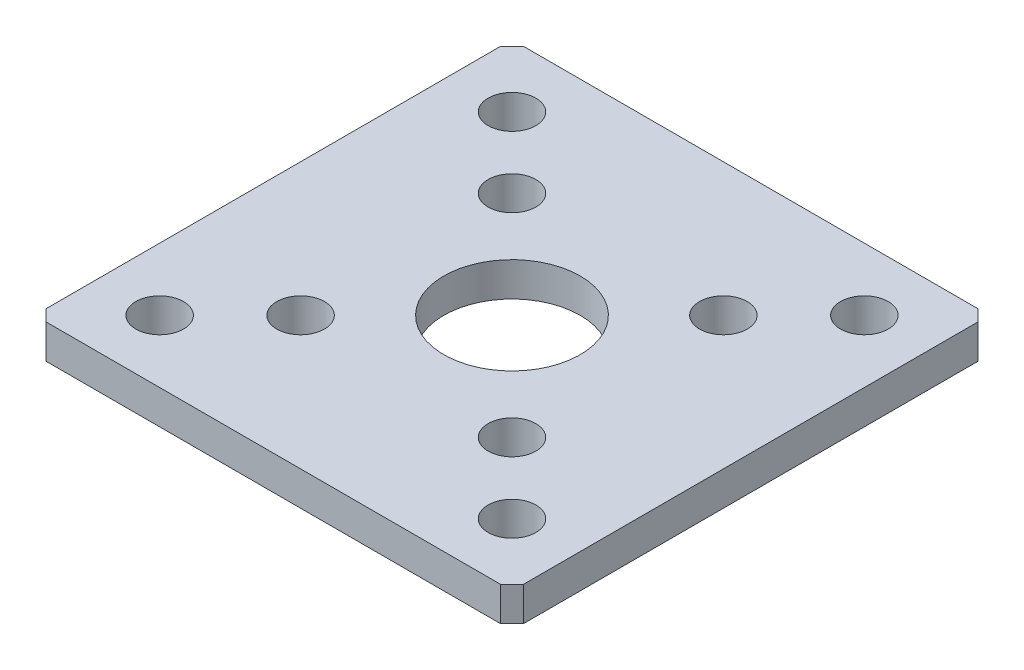
ISO-10303-21;
HEADER;
FILE_DESCRIPTION(('STEP AP214'),'2;1');
FILE_NAME('part.step','',(''),(''),'','','');
FILE_SCHEMA(('AUTOMOTIVE_DESIGN { 1 0 10303 214 1 1 1 1 }'));
ENDSEC;
DATA;
#1=APPLICATION_CONTEXT('core data for automotive mechanical design processes');
#2=APPLICATION_PROTOCOL_DEFINITION('international standard','automotive_design',2000,#1);
#3=PRODUCT_CONTEXT('',#1,'mechanical');
#4=PRODUCT('Part','Part','',(#3));
#5=PRODUCT_RELATED_PRODUCT_CATEGORY('part','',(#4));
#6=PRODUCT_DEFINITION_FORMATION('','',#4);
#7=PRODUCT_DEFINITION_CONTEXT('part definition',#1,'design');
#8=PRODUCT_DEFINITION('design','',#6,#7);
#9=PRODUCT_DEFINITION_SHAPE('','',#8);
#10=(LENGTH_UNIT() NAMED_UNIT(*) SI_UNIT(.MILLI.,.METRE.));
#11=(NAMED_UNIT(*) PLANE_ANGLE_UNIT() SI_UNIT($,.RADIAN.));
#12=(NAMED_UNIT(*) SI_UNIT($,.STERADIAN.) SOLID_ANGLE_UNIT());
#13=UNCERTAINTY_MEASURE_WITH_UNIT(LENGTH_MEASURE(1.E-05),#10,'distance_accuracy_value','');
#14=(GEOMETRIC_REPRESENTATION_CONTEXT(3) GLOBAL_UNCERTAINTY_ASSIGNED_CONTEXT((#13)) GLOBAL_UNIT_ASSIGNED_CONTEXT((#10,
#11,#12)) REPRESENTATION_CONTEXT('',''));
#15=CARTESIAN_POINT('',(0.,0.,0.));
#16=DIRECTION('',(0.,0.,1.));
#17=DIRECTION('',(1.,0.,0.));
#18=AXIS2_PLACEMENT_3D('',#15,#16,#17);
#19=CARTESIAN_POINT('',(21.,3.,21.));
#20=DIRECTION('',(-1.,0.,0.));
#21=DIRECTION('',(0.,0.,1.));
#22=AXIS2_PLACEMENT_3D('',#19,#20,#21);
#23=PLANE('',#22);
#24=DIRECTION('',(0.,0.,-1.));
#25=VECTOR('',#24,1.);
#26=CARTESIAN_POINT('',(21.,0.,21.));
#27=LINE('',#26,#25);
#28=CARTESIAN_POINT('',(21.,0.,20.));
#29=VERTEX_POINT('',#28);
#30=CARTESIAN_POINT('',(21.,0.,-20.));
#31=VERTEX_POINT('',#30);
#32=EDGE_CURVE('E128',#29,#31,#27,.T.);
#33=ORIENTED_EDGE('',*,*,#32,.T.);
#34=DIRECTION('',(0.,1.,0.));
#35=VECTOR('',#34,1.);
#36=CARTESIAN_POINT('',(21.,3.,-20.));
#37=LINE('',#36,#35);
#38=CARTESIAN_POINT('',(21.,3.,-20.));
#39=VERTEX_POINT('',#38);
#40=EDGE_CURVE('E106',#31,#39,#37,.T.);
#41=ORIENTED_EDGE('',*,*,#40,.T.);
#42=DIRECTION('',(0.,0.,-1.));
#43=VECTOR('',#42,1.);
#44=CARTESIAN_POINT('',(21.,3.,21.));
#45=LINE('',#44,#43);
#46=CARTESIAN_POINT('',(21.,3.,20.));
#47=VERTEX_POINT('',#46);
#48=EDGE_CURVE('E138',#47,#39,#45,.T.);
#49=ORIENTED_EDGE('',*,*,#48,.F.);
#50=DIRECTION('',(0.,-1.,0.));
#51=VECTOR('',#50,1.);
#52=CARTESIAN_POINT('',(21.,3.,20.));
#53=LINE('',#52,#51);
#54=EDGE_CURVE('E111',#47,#29,#53,.T.);
#55=ORIENTED_EDGE('',*,*,#54,.T.);
#56=EDGE_LOOP('',(#33,#41,#49,#55));
#57=FACE_BOUND('',#56,.T.);
#58=ADVANCED_FACE('F35',(#57),#23,.F.);
#59=CARTESIAN_POINT('',(-21.,3.,-21.));
#60=DIRECTION('',(0.,0.,1.));
#61=DIRECTION('',(1.,0.,0.));
#62=AXIS2_PLACEMENT_3D('',#59,#60,#61);
#63=PLANE('',#62);
#64=DIRECTION('',(-1.,0.,0.));
#65=VECTOR('',#64,1.);
#66=CARTESIAN_POINT('',(-21.,3.,-21.));
#67=LINE('',#66,#65);
#68=CARTESIAN_POINT('',(20.,3.,-21.));
#69=VERTEX_POINT('',#68);
#70=CARTESIAN_POINT('',(-20.,3.,-21.));
#71=VERTEX_POINT('',#70);
#72=EDGE_CURVE('E121',#69,#71,#67,.T.);
#73=ORIENTED_EDGE('',*,*,#72,.F.);
#74=DIRECTION('',(0.,-1.,0.));
#75=VECTOR('',#74,1.);
#76=CARTESIAN_POINT('',(20.,3.,-21.));
#77=LINE('',#76,#75);
#78=CARTESIAN_POINT('',(20.,0.,-21.));
#79=VERTEX_POINT('',#78);
#80=EDGE_CURVE('E105',#69,#79,#77,.T.);
#81=ORIENTED_EDGE('',*,*,#80,.T.);
#82=DIRECTION('',(-1.,0.,0.));
#83=VECTOR('',#82,1.);
#84=CARTESIAN_POINT('',(-21.,0.,-21.));
#85=LINE('',#84,#83);
#86=CARTESIAN_POINT('',(-20.,0.,-21.));
#87=VERTEX_POINT('',#86);
#88=EDGE_CURVE('E118',#79,#87,#85,.T.);
#89=ORIENTED_EDGE('',*,*,#88,.T.);
#90=DIRECTION('',(0.,1.,0.));
#91=VECTOR('',#90,1.);
#92=CARTESIAN_POINT('',(-20.,3.,-21.));
#93=LINE('',#92,#91);
#94=EDGE_CURVE('E123',#87,#71,#93,.T.);
#95=ORIENTED_EDGE('',*,*,#94,.T.);
#96=EDGE_LOOP('',(#73,#81,#89,#95));
#97=FACE_BOUND('',#96,.T.);
#98=ADVANCED_FACE('F117',(#97),#63,.F.);
#99=CARTESIAN_POINT('',(-21.,3.,21.));
#100=DIRECTION('',(1.,0.,0.));
#101=DIRECTION('',(0.,0.,-1.));
#102=AXIS2_PLACEMENT_3D('',#99,#100,#101);
#103=PLANE('',#102);
#104=DIRECTION('',(0.,0.,1.));
#105=VECTOR('',#104,1.);
#106=CARTESIAN_POINT('',(-21.,0.,21.));
#107=LINE('',#106,#105);
#108=CARTESIAN_POINT('',(-21.,0.,-20.));
#109=VERTEX_POINT('',#108);
#110=CARTESIAN_POINT('',(-21.,0.,20.));
#111=VERTEX_POINT('',#110);
#112=EDGE_CURVE('E127',#109,#111,#107,.T.);
#113=ORIENTED_EDGE('',*,*,#112,.T.);
#114=DIRECTION('',(0.,1.,0.));
#115=VECTOR('',#114,1.);
#116=CARTESIAN_POINT('',(-21.,3.,20.));
#117=LINE('',#116,#115);
#118=CARTESIAN_POINT('',(-21.,3.,20.));
#119=VERTEX_POINT('',#118);
#120=EDGE_CURVE('E11',#111,#119,#117,.T.);
#121=ORIENTED_EDGE('',*,*,#120,.T.);
#122=DIRECTION('',(0.,0.,1.));
#123=VECTOR('',#122,1.);
#124=CARTESIAN_POINT('',(-21.,3.,21.));
#125=LINE('',#124,#123);
#126=CARTESIAN_POINT('',(-21.,3.,-20.));
#127=VERTEX_POINT('',#126);
#128=EDGE_CURVE('E164',#127,#119,#125,.T.);
#129=ORIENTED_EDGE('',*,*,#128,.F.);
#130=DIRECTION('',(0.,-1.,0.));
#131=VECTOR('',#130,1.);
#132=CARTESIAN_POINT('',(-21.,3.,-20.));
#133=LINE('',#132,#131);
#134=EDGE_CURVE('E43',#127,#109,#133,.T.);
#135=ORIENTED_EDGE('',*,*,#134,.T.);
#136=EDGE_LOOP('',(#113,#121,#129,#135));
#137=FACE_BOUND('',#136,.T.);
#138=ADVANCED_FACE('F162',(#137),#103,.F.);
#139=CARTESIAN_POINT('',(-21.,3.,21.));
#140=DIRECTION('',(0.,0.,-1.));
#141=DIRECTION('',(-1.,0.,0.));
#142=AXIS2_PLACEMENT_3D('',#139,#140,#141);
#143=PLANE('',#142);
#144=DIRECTION('',(1.,0.,0.));
#145=VECTOR('',#144,1.);
#146=CARTESIAN_POINT('',(-21.,0.,21.));
#147=LINE('',#146,#145);
#148=CARTESIAN_POINT('',(-20.,0.,21.));
#149=VERTEX_POINT('',#148);
#150=CARTESIAN_POINT('',(20.,0.,21.));
#151=VERTEX_POINT('',#150);
#152=EDGE_CURVE('E131',#149,#151,#147,.T.);
#153=ORIENTED_EDGE('',*,*,#152,.T.);
#154=DIRECTION('',(0.,1.,0.));
#155=VECTOR('',#154,1.);
#156=CARTESIAN_POINT('',(20.,3.,21.));
#157=LINE('',#156,#155);
#158=CARTESIAN_POINT('',(20.,3.,21.));
#159=VERTEX_POINT('',#158);
#160=EDGE_CURVE('E50',#151,#159,#157,.T.);
#161=ORIENTED_EDGE('',*,*,#160,.T.);
#162=DIRECTION('',(1.,0.,0.));
#163=VECTOR('',#162,1.);
#164=CARTESIAN_POINT('',(-21.,3.,21.));
#165=LINE('',#164,#163);
#166=CARTESIAN_POINT('',(-20.,3.,21.));
#167=VERTEX_POINT('',#166);
#168=EDGE_CURVE('E139',#167,#159,#165,.T.);
#169=ORIENTED_EDGE('',*,*,#168,.F.);
#170=DIRECTION('',(0.,-1.,0.));
#171=VECTOR('',#170,1.);
#172=CARTESIAN_POINT('',(-20.,3.,21.));
#173=LINE('',#172,#171);
#174=EDGE_CURVE('E155',#167,#149,#173,.T.);
#175=ORIENTED_EDGE('',*,*,#174,.T.);
#176=EDGE_LOOP('',(#153,#161,#169,#175));
#177=FACE_BOUND('',#176,.T.);
#178=ADVANCED_FACE('F171',(#177),#143,.F.);
#179=CARTESIAN_POINT('',(0.,3.,0.));
#180=DIRECTION('',(0.,-1.,0.));
#181=DIRECTION('',(0.,0.,-1.));
#182=AXIS2_PLACEMENT_3D('',#179,#180,#181);
#183=PLANE('',#182);
#184=CARTESIAN_POINT('',(-15.4999999999999,3.,15.5000000000001));
#185=DIRECTION('',(0.,1.,0.));
#186=DIRECTION('',(1.,0.,0.));
#187=AXIS2_PLACEMENT_3D('',#184,#185,#186);
#188=CIRCLE('',#187,2.1);
#189=CARTESIAN_POINT('',(-13.3999999999999,3.,15.5));
#190=VERTEX_POINT('',#189);
#191=EDGE_CURVE('E226',#190,#190,#188,.T.);
#192=ORIENTED_EDGE('',*,*,#191,.F.);
#193=EDGE_LOOP('',(#192));
#194=FACE_BOUND('',#193,.T.);
#195=CARTESIAN_POINT('',(15.5,3.,15.5));
#196=DIRECTION('',(0.,1.,0.));
#197=DIRECTION('',(0.,0.,-1.));
#198=AXIS2_PLACEMENT_3D('',#195,#196,#197);
#199=CIRCLE('',#198,2.1);
#200=CARTESIAN_POINT('',(15.5,3.,13.4));
#201=VERTEX_POINT('',#200);
#202=EDGE_CURVE('E220',#201,#201,#199,.T.);
#203=ORIENTED_EDGE('',*,*,#202,.F.);
#204=EDGE_LOOP('',(#203));
#205=FACE_BOUND('',#204,.T.);
#206=CARTESIAN_POINT('',(15.4999999999998,3.,-15.5000000000002));
#207=DIRECTION('',(0.,1.,0.));
#208=DIRECTION('',(-1.,0.,0.));
#209=AXIS2_PLACEMENT_3D('',#206,#207,#208);
#210=CIRCLE('',#209,2.1);
#211=CARTESIAN_POINT('',(13.3999999999998,3.,-15.5000000000001));
#212=VERTEX_POINT('',#211);
#213=EDGE_CURVE('E214',#212,#212,#210,.T.);
#214=ORIENTED_EDGE('',*,*,#213,.F.);
#215=EDGE_LOOP('',(#214));
#216=FACE_BOUND('',#215,.T.);
#217=CARTESIAN_POINT('',(-9.29999999999997,3.,9.30000000000003));
#218=DIRECTION('',(0.,1.,0.));
#219=DIRECTION('',(1.,0.,0.));
#220=AXIS2_PLACEMENT_3D('',#217,#218,#219);
#221=CIRCLE('',#220,2.1);
#222=CARTESIAN_POINT('',(-7.19999999999997,3.,9.30000000000003));
#223=VERTEX_POINT('',#222);
#224=EDGE_CURVE('E209',#223,#223,#221,.T.);
#225=ORIENTED_EDGE('',*,*,#224,.F.);
#226=EDGE_LOOP('',(#225));
#227=FACE_BOUND('',#226,.T.);
#228=CARTESIAN_POINT('',(9.3,3.,9.3));
#229=DIRECTION('',(0.,1.,0.));
#230=DIRECTION('',(0.,0.,-1.));
#231=AXIS2_PLACEMENT_3D('',#228,#229,#230);
#232=CIRCLE('',#231,2.1);
#233=CARTESIAN_POINT('',(9.3,3.,7.2));
#234=VERTEX_POINT('',#233);
#235=EDGE_CURVE('E203',#234,#234,#232,.T.);
#236=ORIENTED_EDGE('',*,*,#235,.F.);
#237=EDGE_LOOP('',(#236));
#238=FACE_BOUND('',#237,.T.);
#239=CARTESIAN_POINT('',(9.2999999999999,3.,-9.3000000000001));
#240=DIRECTION('',(0.,1.,0.));
#241=DIRECTION('',(-1.,0.,0.));
#242=AXIS2_PLACEMENT_3D('',#239,#240,#241);
#243=CIRCLE('',#242,2.1);
#244=CARTESIAN_POINT('',(7.1999999999999,3.,-9.30000000000008));
#245=VERTEX_POINT('',#244);
#246=EDGE_CURVE('E196',#245,#245,#243,.T.);
#247=ORIENTED_EDGE('',*,*,#246,.F.);
#248=EDGE_LOOP('',(#247));
#249=FACE_BOUND('',#248,.T.);
#250=CARTESIAN_POINT('',(-15.5,3.,-15.5));
#251=DIRECTION('',(0.,1.,0.));
#252=DIRECTION('',(0.,0.,1.));
#253=AXIS2_PLACEMENT_3D('',#250,#251,#252);
#254=CIRCLE('',#253,2.1);
#255=CARTESIAN_POINT('',(-15.5,3.,-13.4));
#256=VERTEX_POINT('',#255);
#257=EDGE_CURVE('E190',#256,#256,#254,.T.);
#258=ORIENTED_EDGE('',*,*,#257,.F.);
#259=EDGE_LOOP('',(#258));
#260=FACE_BOUND('',#259,.T.);
#261=CARTESIAN_POINT('',(-9.3,3.,-9.3));
#262=DIRECTION('',(0.,1.,0.));
#263=DIRECTION('',(0.,0.,1.));
#264=AXIS2_PLACEMENT_3D('',#261,#262,#263);
#265=CIRCLE('',#264,2.1);
#266=CARTESIAN_POINT('',(-9.3,3.,-7.2));
#267=VERTEX_POINT('',#266);
#268=EDGE_CURVE('E184',#267,#267,#265,.T.);
#269=ORIENTED_EDGE('',*,*,#268,.F.);
#270=EDGE_LOOP('',(#269));
#271=FACE_BOUND('',#270,.T.);
#272=CARTESIAN_POINT('',(0.,3.,0.));
#273=DIRECTION('',(0.,-1.,0.));
#274=DIRECTION('',(0.,0.,-1.));
#275=AXIS2_PLACEMENT_3D('',#272,#273,#274);
#276=CIRCLE('',#275,6.);
#277=CARTESIAN_POINT('',(0.,3.,-6.));
#278=VERTEX_POINT('',#277);
#279=EDGE_CURVE('E133',#278,#278,#276,.T.);
#280=ORIENTED_EDGE('',*,*,#279,.T.);
#281=EDGE_LOOP('',(#280));
#282=FACE_BOUND('',#281,.T.);
#283=ORIENTED_EDGE('',*,*,#48,.T.);
#284=DIRECTION('',(0.707106781186548,0.,0.707106781186548));
#285=VECTOR('',#284,1.);
#286=CARTESIAN_POINT('',(20.,3.,-21.));
#287=LINE('',#286,#285);
#288=EDGE_CURVE('E153',#39,#69,#287,.F.);
#289=ORIENTED_EDGE('',*,*,#288,.T.);
#290=ORIENTED_EDGE('',*,*,#72,.T.);
#291=DIRECTION('',(0.707106781186548,0.,-0.707106781186548));
#292=VECTOR('',#291,1.);
#293=CARTESIAN_POINT('',(-21.,3.,-20.));
#294=LINE('',#293,#292);
#295=EDGE_CURVE('E148',#71,#127,#294,.F.);
#296=ORIENTED_EDGE('',*,*,#295,.T.);
#297=ORIENTED_EDGE('',*,*,#128,.T.);
#298=DIRECTION('',(-0.707106781186548,0.,-0.707106781186548));
#299=VECTOR('',#298,1.);
#300=CARTESIAN_POINT('',(-20.,3.,21.));
#301=LINE('',#300,#299);
#302=EDGE_CURVE('E57',#119,#167,#301,.F.);
#303=ORIENTED_EDGE('',*,*,#302,.T.);
#304=ORIENTED_EDGE('',*,*,#168,.T.);
#305=DIRECTION('',(-0.707106781186548,0.,0.707106781186548));
#306=VECTOR('',#305,1.);
#307=CARTESIAN_POINT('',(21.,3.,20.));
#308=LINE('',#307,#306);
#309=EDGE_CURVE('E151',#159,#47,#308,.F.);
#310=ORIENTED_EDGE('',*,*,#309,.T.);
#311=EDGE_LOOP('',(#283,#289,#290,#296,#297,#303,#304,#310));
#312=FACE_BOUND('',#311,.T.);
#313=ADVANCED_FACE('F241',(#194,#205,#216,#227,#238,#249,#260,#271,#282,#312),#183,.F.);
#314=CARTESIAN_POINT('',(0.,0.,0.));
#315=DIRECTION('',(0.,-1.,0.));
#316=DIRECTION('',(0.,0.,-1.));
#317=AXIS2_PLACEMENT_3D('',#314,#315,#316);
#318=PLANE('',#317);
#319=CARTESIAN_POINT('',(-15.4999999999999,0.,15.5000000000001));
#320=DIRECTION('',(0.,1.,0.));
#321=DIRECTION('',(1.,0.,0.));
#322=AXIS2_PLACEMENT_3D('',#319,#320,#321);
#323=CIRCLE('',#322,2.1);
#324=CARTESIAN_POINT('',(-13.3999999999999,0.,15.5));
#325=VERTEX_POINT('',#324);
#326=EDGE_CURVE('E200',#325,#325,#323,.T.);
#327=ORIENTED_EDGE('',*,*,#326,.T.);
#328=EDGE_LOOP('',(#327));
#329=FACE_BOUND('',#328,.T.);
#330=CARTESIAN_POINT('',(15.5,0.,15.5));
#331=DIRECTION('',(0.,1.,0.));
#332=DIRECTION('',(0.,0.,-1.));
#333=AXIS2_PLACEMENT_3D('',#330,#331,#332);
#334=CIRCLE('',#333,2.1);
#335=CARTESIAN_POINT('',(15.5,0.,13.4));
#336=VERTEX_POINT('',#335);
#337=EDGE_CURVE('E223',#336,#336,#334,.T.);
#338=ORIENTED_EDGE('',*,*,#337,.T.);
#339=EDGE_LOOP('',(#338));
#340=FACE_BOUND('',#339,.T.);
#341=CARTESIAN_POINT('',(15.4999999999998,0.,-15.5000000000002));
#342=DIRECTION('',(0.,1.,0.));
#343=DIRECTION('',(-1.,0.,0.));
#344=AXIS2_PLACEMENT_3D('',#341,#342,#343);
#345=CIRCLE('',#344,2.1);
#346=CARTESIAN_POINT('',(13.3999999999998,0.,-15.5000000000001));
#347=VERTEX_POINT('',#346);
#348=EDGE_CURVE('E217',#347,#347,#345,.T.);
#349=ORIENTED_EDGE('',*,*,#348,.T.);
#350=EDGE_LOOP('',(#349));
#351=FACE_BOUND('',#350,.T.);
#352=CARTESIAN_POINT('',(-9.29999999999997,0.,9.30000000000003));
#353=DIRECTION('',(0.,1.,0.));
#354=DIRECTION('',(1.,0.,0.));
#355=AXIS2_PLACEMENT_3D('',#352,#353,#354);
#356=CIRCLE('',#355,2.1);
#357=CARTESIAN_POINT('',(-7.19999999999997,0.,9.30000000000003));
#358=VERTEX_POINT('',#357);
#359=EDGE_CURVE('E193',#358,#358,#356,.T.);
#360=ORIENTED_EDGE('',*,*,#359,.T.);
#361=EDGE_LOOP('',(#360));
#362=FACE_BOUND('',#361,.T.);
#363=CARTESIAN_POINT('',(9.3,0.,9.3));
#364=DIRECTION('',(0.,1.,0.));
#365=DIRECTION('',(0.,0.,-1.));
#366=AXIS2_PLACEMENT_3D('',#363,#364,#365);
#367=CIRCLE('',#366,2.1);
#368=CARTESIAN_POINT('',(9.3,0.,7.2));
#369=VERTEX_POINT('',#368);
#370=EDGE_CURVE('E206',#369,#369,#367,.T.);
#371=ORIENTED_EDGE('',*,*,#370,.T.);
#372=EDGE_LOOP('',(#371));
#373=FACE_BOUND('',#372,.T.);
#374=CARTESIAN_POINT('',(9.2999999999999,0.,-9.3000000000001));
#375=DIRECTION('',(0.,1.,0.));
#376=DIRECTION('',(-1.,0.,0.));
#377=AXIS2_PLACEMENT_3D('',#374,#375,#376);
#378=CIRCLE('',#377,2.1);
#379=CARTESIAN_POINT('',(7.1999999999999,0.,-9.30000000000008));
#380=VERTEX_POINT('',#379);
#381=EDGE_CURVE('E199',#380,#380,#378,.T.);
#382=ORIENTED_EDGE('',*,*,#381,.T.);
#383=EDGE_LOOP('',(#382));
#384=FACE_BOUND('',#383,.T.);
#385=CARTESIAN_POINT('',(-15.5,0.,-15.5));
#386=DIRECTION('',(0.,1.,0.));
#387=DIRECTION('',(0.,0.,1.));
#388=AXIS2_PLACEMENT_3D('',#385,#386,#387);
#389=CIRCLE('',#388,2.1);
#390=CARTESIAN_POINT('',(-15.5,0.,-13.4));
#391=VERTEX_POINT('',#390);
#392=EDGE_CURVE('E187',#391,#391,#389,.T.);
#393=ORIENTED_EDGE('',*,*,#392,.T.);
#394=EDGE_LOOP('',(#393));
#395=FACE_BOUND('',#394,.T.);
#396=CARTESIAN_POINT('',(-9.3,0.,-9.3));
#397=DIRECTION('',(0.,1.,0.));
#398=DIRECTION('',(0.,0.,1.));
#399=AXIS2_PLACEMENT_3D('',#396,#397,#398);
#400=CIRCLE('',#399,2.1);
#401=CARTESIAN_POINT('',(-9.3,0.,-7.2));
#402=VERTEX_POINT('',#401);
#403=EDGE_CURVE('E181',#402,#402,#400,.T.);
#404=ORIENTED_EDGE('',*,*,#403,.T.);
#405=EDGE_LOOP('',(#404));
#406=FACE_BOUND('',#405,.T.);
#407=CARTESIAN_POINT('',(0.,0.,0.));
#408=DIRECTION('',(0.,-1.,0.));
#409=DIRECTION('',(0.,0.,-1.));
#410=AXIS2_PLACEMENT_3D('',#407,#408,#409);
#411=CIRCLE('',#410,6.);
#412=CARTESIAN_POINT('',(0.,0.,-6.));
#413=VERTEX_POINT('',#412);
#414=EDGE_CURVE('E178',#413,#413,#411,.T.);
#415=ORIENTED_EDGE('',*,*,#414,.F.);
#416=EDGE_LOOP('',(#415));
#417=FACE_BOUND('',#416,.T.);
#418=ORIENTED_EDGE('',*,*,#88,.F.);
#419=DIRECTION('',(-0.707106781186548,0.,-0.707106781186548));
#420=VECTOR('',#419,1.);
#421=CARTESIAN_POINT('',(20.5,0.,-20.5));
#422=LINE('',#421,#420);
#423=EDGE_CURVE('E101',#79,#31,#422,.F.);
#424=ORIENTED_EDGE('',*,*,#423,.T.);
#425=ORIENTED_EDGE('',*,*,#32,.F.);
#426=DIRECTION('',(0.707106781186548,0.,-0.707106781186548));
#427=VECTOR('',#426,1.);
#428=CARTESIAN_POINT('',(20.5,0.,20.5));
#429=LINE('',#428,#427);
#430=EDGE_CURVE('E112',#29,#151,#429,.F.);
#431=ORIENTED_EDGE('',*,*,#430,.T.);
#432=ORIENTED_EDGE('',*,*,#152,.F.);
#433=DIRECTION('',(0.707106781186548,0.,0.707106781186548));
#434=VECTOR('',#433,1.);
#435=CARTESIAN_POINT('',(-20.5,0.,20.5));
#436=LINE('',#435,#434);
#437=EDGE_CURVE('E142',#149,#111,#436,.F.);
#438=ORIENTED_EDGE('',*,*,#437,.T.);
#439=ORIENTED_EDGE('',*,*,#112,.F.);
#440=DIRECTION('',(-0.707106781186548,0.,0.707106781186548));
#441=VECTOR('',#440,1.);
#442=CARTESIAN_POINT('',(-20.5,0.,-20.5));
#443=LINE('',#442,#441);
#444=EDGE_CURVE('E122',#109,#87,#443,.F.);
#445=ORIENTED_EDGE('',*,*,#444,.T.);
#446=EDGE_LOOP('',(#418,#424,#425,#431,#432,#438,#439,#445));
#447=FACE_BOUND('',#446,.T.);
#448=ADVANCED_FACE('F125',(#329,#340,#351,#362,#373,#384,#395,#406,#417,#447),#318,.T.);
#449=CARTESIAN_POINT('',(0.,3.,0.));
#450=DIRECTION('',(0.,-1.,0.));
#451=DIRECTION('',(0.,0.,-1.));
#452=AXIS2_PLACEMENT_3D('',#449,#450,#451);
#453=CYLINDRICAL_SURFACE('',#452,6.);
#454=ORIENTED_EDGE('',*,*,#279,.F.);
#455=EDGE_LOOP('',(#454));
#456=FACE_BOUND('',#455,.T.);
#457=ORIENTED_EDGE('',*,*,#414,.T.);
#458=EDGE_LOOP('',(#457));
#459=FACE_BOUND('',#458,.T.);
#460=ADVANCED_FACE('F284',(#456,#459),#453,.F.);
#461=CARTESIAN_POINT('',(-9.3,0.,-9.3));
#462=DIRECTION('',(0.,1.,0.));
#463=DIRECTION('',(0.,0.,1.));
#464=AXIS2_PLACEMENT_3D('',#461,#462,#463);
#465=CYLINDRICAL_SURFACE('',#464,2.1);
#466=ORIENTED_EDGE('',*,*,#403,.F.);
#467=EDGE_LOOP('',(#466));
#468=FACE_BOUND('',#467,.T.);
#469=ORIENTED_EDGE('',*,*,#268,.T.);
#470=EDGE_LOOP('',(#469));
#471=FACE_BOUND('',#470,.T.);
#472=ADVANCED_FACE('F288',(#468,#471),#465,.F.);
#473=CARTESIAN_POINT('',(-15.5,0.,-15.5));
#474=DIRECTION('',(0.,1.,0.));
#475=DIRECTION('',(0.,0.,1.));
#476=AXIS2_PLACEMENT_3D('',#473,#474,#475);
#477=CYLINDRICAL_SURFACE('',#476,2.1);
#478=ORIENTED_EDGE('',*,*,#392,.F.);
#479=EDGE_LOOP('',(#478));
#480=FACE_BOUND('',#479,.T.);
#481=ORIENTED_EDGE('',*,*,#257,.T.);
#482=EDGE_LOOP('',(#481));
#483=FACE_BOUND('',#482,.T.);
#484=ADVANCED_FACE('F292',(#480,#483),#477,.F.);
#485=CARTESIAN_POINT('',(9.2999999999999,0.,-9.3000000000001));
#486=DIRECTION('',(0.,1.,0.));
#487=DIRECTION('',(0.,0.,1.));
#488=AXIS2_PLACEMENT_3D('',#485,#486,#487);
#489=CYLINDRICAL_SURFACE('',#488,2.1);
#490=ORIENTED_EDGE('',*,*,#381,.F.);
#491=EDGE_LOOP('',(#490));
#492=FACE_BOUND('',#491,.T.);
#493=ORIENTED_EDGE('',*,*,#246,.T.);
#494=EDGE_LOOP('',(#493));
#495=FACE_BOUND('',#494,.T.);
#496=ADVANCED_FACE('F296',(#492,#495),#489,.F.);
#497=CARTESIAN_POINT('',(9.3,0.,9.3));
#498=DIRECTION('',(0.,1.,0.));
#499=DIRECTION('',(0.,0.,1.));
#500=AXIS2_PLACEMENT_3D('',#497,#498,#499);
#501=CYLINDRICAL_SURFACE('',#500,2.1);
#502=ORIENTED_EDGE('',*,*,#370,.F.);
#503=EDGE_LOOP('',(#502));
#504=FACE_BOUND('',#503,.T.);
#505=ORIENTED_EDGE('',*,*,#235,.T.);
#506=EDGE_LOOP('',(#505));
#507=FACE_BOUND('',#506,.T.);
#508=ADVANCED_FACE('F300',(#504,#507),#501,.F.);
#509=CARTESIAN_POINT('',(-9.29999999999997,0.,9.30000000000003));
#510=DIRECTION('',(0.,1.,0.));
#511=DIRECTION('',(0.,0.,1.));
#512=AXIS2_PLACEMENT_3D('',#509,#510,#511);
#513=CYLINDRICAL_SURFACE('',#512,2.1);
#514=ORIENTED_EDGE('',*,*,#359,.F.);
#515=EDGE_LOOP('',(#514));
#516=FACE_BOUND('',#515,.T.);
#517=ORIENTED_EDGE('',*,*,#224,.T.);
#518=EDGE_LOOP('',(#517));
#519=FACE_BOUND('',#518,.T.);
#520=ADVANCED_FACE('F304',(#516,#519),#513,.F.);
#521=CARTESIAN_POINT('',(15.4999999999998,0.,-15.5000000000002));
#522=DIRECTION('',(0.,1.,0.));
#523=DIRECTION('',(0.,0.,1.));
#524=AXIS2_PLACEMENT_3D('',#521,#522,#523);
#525=CYLINDRICAL_SURFACE('',#524,2.1);
#526=ORIENTED_EDGE('',*,*,#348,.F.);
#527=EDGE_LOOP('',(#526));
#528=FACE_BOUND('',#527,.T.);
#529=ORIENTED_EDGE('',*,*,#213,.T.);
#530=EDGE_LOOP('',(#529));
#531=FACE_BOUND('',#530,.T.);
#532=ADVANCED_FACE('F308',(#528,#531),#525,.F.);
#533=CARTESIAN_POINT('',(15.5,0.,15.5));
#534=DIRECTION('',(0.,1.,0.));
#535=DIRECTION('',(0.,0.,1.));
#536=AXIS2_PLACEMENT_3D('',#533,#534,#535);
#537=CYLINDRICAL_SURFACE('',#536,2.1);
#538=ORIENTED_EDGE('',*,*,#337,.F.);
#539=EDGE_LOOP('',(#538));
#540=FACE_BOUND('',#539,.T.);
#541=ORIENTED_EDGE('',*,*,#202,.T.);
#542=EDGE_LOOP('',(#541));
#543=FACE_BOUND('',#542,.T.);
#544=ADVANCED_FACE('F237',(#540,#543),#537,.F.);
#545=CARTESIAN_POINT('',(-15.4999999999999,0.,15.5000000000001));
#546=DIRECTION('',(0.,1.,0.));
#547=DIRECTION('',(0.,0.,1.));
#548=AXIS2_PLACEMENT_3D('',#545,#546,#547);
#549=CYLINDRICAL_SURFACE('',#548,2.1);
#550=ORIENTED_EDGE('',*,*,#326,.F.);
#551=EDGE_LOOP('',(#550));
#552=FACE_BOUND('',#551,.T.);
#553=ORIENTED_EDGE('',*,*,#191,.T.);
#554=EDGE_LOOP('',(#553));
#555=FACE_BOUND('',#554,.T.);
#556=ADVANCED_FACE('F234',(#552,#555),#549,.F.);
#557=CARTESIAN_POINT('',(20.,3.,-21.));
#558=DIRECTION('',(-0.707106781186547,0.,0.707106781186547));
#559=DIRECTION('',(0.,-1.,0.));
#560=AXIS2_PLACEMENT_3D('',#557,#558,#559);
#561=PLANE('',#560);
#562=ORIENTED_EDGE('',*,*,#288,.F.);
#563=ORIENTED_EDGE('',*,*,#40,.F.);
#564=ORIENTED_EDGE('',*,*,#423,.F.);
#565=ORIENTED_EDGE('',*,*,#80,.F.);
#566=EDGE_LOOP('',(#562,#563,#564,#565));
#567=FACE_BOUND('',#566,.T.);
#568=ADVANCED_FACE('F104',(#567),#561,.F.);
#569=CARTESIAN_POINT('',(21.,3.,20.));
#570=DIRECTION('',(-0.707106781186547,0.,-0.707106781186547));
#571=DIRECTION('',(0.,-1.,0.));
#572=AXIS2_PLACEMENT_3D('',#569,#570,#571);
#573=PLANE('',#572);
#574=ORIENTED_EDGE('',*,*,#309,.F.);
#575=ORIENTED_EDGE('',*,*,#160,.F.);
#576=ORIENTED_EDGE('',*,*,#430,.F.);
#577=ORIENTED_EDGE('',*,*,#54,.F.);
#578=EDGE_LOOP('',(#574,#575,#576,#577));
#579=FACE_BOUND('',#578,.T.);
#580=ADVANCED_FACE('F264',(#579),#573,.F.);
#581=CARTESIAN_POINT('',(-20.,3.,21.));
#582=DIRECTION('',(0.707106781186547,0.,-0.707106781186547));
#583=DIRECTION('',(0.,-1.,0.));
#584=AXIS2_PLACEMENT_3D('',#581,#582,#583);
#585=PLANE('',#584);
#586=ORIENTED_EDGE('',*,*,#302,.F.);
#587=ORIENTED_EDGE('',*,*,#120,.F.);
#588=ORIENTED_EDGE('',*,*,#437,.F.);
#589=ORIENTED_EDGE('',*,*,#174,.F.);
#590=EDGE_LOOP('',(#586,#587,#588,#589));
#591=FACE_BOUND('',#590,.T.);
#592=ADVANCED_FACE('F170',(#591),#585,.F.);
#593=CARTESIAN_POINT('',(-21.,3.,-20.));
#594=DIRECTION('',(0.707106781186547,0.,0.707106781186547));
#595=DIRECTION('',(0.,-1.,0.));
#596=AXIS2_PLACEMENT_3D('',#593,#594,#595);
#597=PLANE('',#596);
#598=ORIENTED_EDGE('',*,*,#295,.F.);
#599=ORIENTED_EDGE('',*,*,#94,.F.);
#600=ORIENTED_EDGE('',*,*,#444,.F.);
#601=ORIENTED_EDGE('',*,*,#134,.F.);
#602=EDGE_LOOP('',(#598,#599,#600,#601));
#603=FACE_BOUND('',#602,.T.);
#604=ADVANCED_FACE('F37',(#603),#597,.F.);
#605=CLOSED_SHELL('',(#58,#98,#138,#178,#313,#448,#460,#472,#484,#496,#508,#520,#532,#544,#556,
#568,#580,#592,#604));
#606=MANIFOLD_SOLID_BREP('B2',#605);
#607=ADVANCED_BREP_SHAPE_REPRESENTATION('',(#18,#606),#14);
#608=SHAPE_DEFINITION_REPRESENTATION(#9,#607);
ENDSEC;
END-ISO-10303-21;
